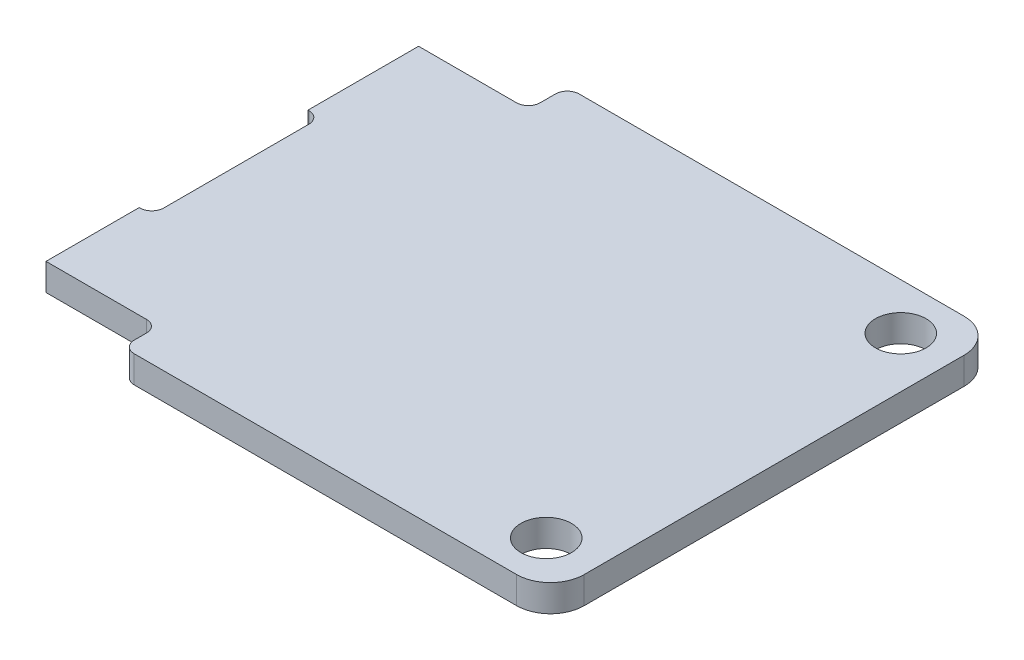
ISO-10303-21;
HEADER;
FILE_DESCRIPTION(('STEP AP214'),'2;1');
FILE_NAME('part.step','',(''),(''),'','','');
FILE_SCHEMA(('AUTOMOTIVE_DESIGN { 1 0 10303 214 1 1 1 1 }'));
ENDSEC;
DATA;
#1=APPLICATION_CONTEXT('core data for automotive mechanical design processes');
#2=APPLICATION_PROTOCOL_DEFINITION('international standard','automotive_design',2000,#1);
#3=PRODUCT_CONTEXT('',#1,'mechanical');
#4=PRODUCT('Part','Part','',(#3));
#5=PRODUCT_RELATED_PRODUCT_CATEGORY('part','',(#4));
#6=PRODUCT_DEFINITION_FORMATION('','',#4);
#7=PRODUCT_DEFINITION_CONTEXT('part definition',#1,'design');
#8=PRODUCT_DEFINITION('design','',#6,#7);
#9=PRODUCT_DEFINITION_SHAPE('','',#8);
#10=(LENGTH_UNIT() NAMED_UNIT(*) SI_UNIT(.MILLI.,.METRE.));
#11=(NAMED_UNIT(*) PLANE_ANGLE_UNIT() SI_UNIT($,.RADIAN.));
#12=(NAMED_UNIT(*) SI_UNIT($,.STERADIAN.) SOLID_ANGLE_UNIT());
#13=UNCERTAINTY_MEASURE_WITH_UNIT(LENGTH_MEASURE(1.E-05),#10,'distance_accuracy_value','');
#14=(GEOMETRIC_REPRESENTATION_CONTEXT(3) GLOBAL_UNCERTAINTY_ASSIGNED_CONTEXT((#13)) GLOBAL_UNIT_ASSIGNED_CONTEXT((#10,
#11,#12)) REPRESENTATION_CONTEXT('',''));
#15=CARTESIAN_POINT('',(0.,0.,0.));
#16=DIRECTION('',(0.,0.,1.));
#17=DIRECTION('',(1.,0.,0.));
#18=AXIS2_PLACEMENT_3D('',#15,#16,#17);
#19=CARTESIAN_POINT('',(-16.1521134954368,1.6,-3.69558790884931));
#20=DIRECTION('',(0.,-1.,0.));
#21=DIRECTION('',(0.,0.,-1.));
#22=AXIS2_PLACEMENT_3D('',#19,#20,#21);
#23=CYLINDRICAL_SURFACE('',#22,0.7);
#24=CARTESIAN_POINT('',(-16.1521134954368,0.,-3.69558790884931));
#25=DIRECTION('',(0.,1.,0.));
#26=DIRECTION('',(0.,0.,1.));
#27=AXIS2_PLACEMENT_3D('',#24,#25,#26);
#28=CIRCLE('',#27,0.7);
#29=CARTESIAN_POINT('',(-15.4521134954368,0.,-3.6955879088493));
#30=VERTEX_POINT('',#29);
#31=CARTESIAN_POINT('',(-16.1521134954368,0.,-4.39558790884931));
#32=VERTEX_POINT('',#31);
#33=EDGE_CURVE('E208',#30,#32,#28,.T.);
#34=ORIENTED_EDGE('',*,*,#33,.F.);
#35=DIRECTION('',(0.,-1.,0.));
#36=VECTOR('',#35,1.);
#37=CARTESIAN_POINT('',(-15.4521134954368,1.6,-3.6955879088493));
#38=LINE('',#37,#36);
#39=CARTESIAN_POINT('',(-15.4521134954368,1.6,-3.6955879088493));
#40=VERTEX_POINT('',#39);
#41=EDGE_CURVE('E11',#40,#30,#38,.T.);
#42=ORIENTED_EDGE('',*,*,#41,.F.);
#43=CARTESIAN_POINT('',(-16.1521134954368,1.6,-3.69558790884931));
#44=DIRECTION('',(0.,1.,0.));
#45=DIRECTION('',(0.,0.,1.));
#46=AXIS2_PLACEMENT_3D('',#43,#44,#45);
#47=CIRCLE('',#46,0.7);
#48=CARTESIAN_POINT('',(-16.1521134954368,1.6,-4.39558790884931));
#49=VERTEX_POINT('',#48);
#50=EDGE_CURVE('E264',#40,#49,#47,.T.);
#51=ORIENTED_EDGE('',*,*,#50,.T.);
#52=DIRECTION('',(0.,-1.,0.));
#53=VECTOR('',#52,1.);
#54=CARTESIAN_POINT('',(-16.1521134954368,1.6,-4.39558790884931));
#55=LINE('',#54,#53);
#56=EDGE_CURVE('E51',#49,#32,#55,.T.);
#57=ORIENTED_EDGE('',*,*,#56,.T.);
#58=EDGE_LOOP('',(#34,#42,#51,#57));
#59=FACE_BOUND('',#58,.T.);
#60=ADVANCED_FACE('F35',(#59),#23,.F.);
#61=CARTESIAN_POINT('',(-15.4521134954368,1.6,0.));
#62=DIRECTION('',(-1.,0.,0.));
#63=DIRECTION('',(0.,0.,1.));
#64=AXIS2_PLACEMENT_3D('',#61,#62,#63);
#65=PLANE('',#64);
#66=DIRECTION('',(0.,0.,-1.));
#67=VECTOR('',#66,1.);
#68=CARTESIAN_POINT('',(-15.4521134954368,0.,0.));
#69=LINE('',#68,#67);
#70=CARTESIAN_POINT('',(-15.4521134954368,0.,4.90441209115069));
#71=VERTEX_POINT('',#70);
#72=EDGE_CURVE('E210',#71,#30,#69,.T.);
#73=ORIENTED_EDGE('',*,*,#72,.F.);
#74=DIRECTION('',(0.,-1.,0.));
#75=VECTOR('',#74,1.);
#76=CARTESIAN_POINT('',(-15.4521134954368,1.6,4.90441209115069));
#77=LINE('',#76,#75);
#78=CARTESIAN_POINT('',(-15.4521134954368,1.6,4.90441209115069));
#79=VERTEX_POINT('',#78);
#80=EDGE_CURVE('E43',#79,#71,#77,.T.);
#81=ORIENTED_EDGE('',*,*,#80,.F.);
#82=DIRECTION('',(0.,0.,-1.));
#83=VECTOR('',#82,1.);
#84=CARTESIAN_POINT('',(-15.4521134954368,1.6,0.));
#85=LINE('',#84,#83);
#86=EDGE_CURVE('E325',#79,#40,#85,.T.);
#87=ORIENTED_EDGE('',*,*,#86,.T.);
#88=ORIENTED_EDGE('',*,*,#41,.T.);
#89=EDGE_LOOP('',(#73,#81,#87,#88));
#90=FACE_BOUND('',#89,.T.);
#91=ADVANCED_FACE('F310',(#90),#65,.T.);
#92=CARTESIAN_POINT('',(-16.1521134954368,1.6,4.90441209115069));
#93=DIRECTION('',(0.,-1.,0.));
#94=DIRECTION('',(0.,0.,-1.));
#95=AXIS2_PLACEMENT_3D('',#92,#93,#94);
#96=CYLINDRICAL_SURFACE('',#95,0.7);
#97=CARTESIAN_POINT('',(-16.1521134954368,0.,4.90441209115069));
#98=DIRECTION('',(0.,1.,0.));
#99=DIRECTION('',(0.,0.,1.));
#100=AXIS2_PLACEMENT_3D('',#97,#98,#99);
#101=CIRCLE('',#100,0.7);
#102=CARTESIAN_POINT('',(-16.1521134954368,0.,5.60441209115069));
#103=VERTEX_POINT('',#102);
#104=EDGE_CURVE('E213',#103,#71,#101,.T.);
#105=ORIENTED_EDGE('',*,*,#104,.F.);
#106=DIRECTION('',(0.,-1.,0.));
#107=VECTOR('',#106,1.);
#108=CARTESIAN_POINT('',(-16.1521134954368,1.6,5.60441209115069));
#109=LINE('',#108,#107);
#110=CARTESIAN_POINT('',(-16.1521134954368,1.6,5.60441209115069));
#111=VERTEX_POINT('',#110);
#112=EDGE_CURVE('E299',#111,#103,#109,.T.);
#113=ORIENTED_EDGE('',*,*,#112,.F.);
#114=CARTESIAN_POINT('',(-16.1521134954368,1.6,4.90441209115069));
#115=DIRECTION('',(0.,1.,0.));
#116=DIRECTION('',(0.,0.,1.));
#117=AXIS2_PLACEMENT_3D('',#114,#115,#116);
#118=CIRCLE('',#117,0.7);
#119=EDGE_CURVE('E306',#111,#79,#118,.T.);
#120=ORIENTED_EDGE('',*,*,#119,.T.);
#121=ORIENTED_EDGE('',*,*,#80,.T.);
#122=EDGE_LOOP('',(#105,#113,#120,#121));
#123=FACE_BOUND('',#122,.T.);
#124=ADVANCED_FACE('F304',(#123),#96,.F.);
#125=CARTESIAN_POINT('',(0.,1.6,5.60441209115069));
#126=DIRECTION('',(0.,0.,1.));
#127=DIRECTION('',(1.,0.,0.));
#128=AXIS2_PLACEMENT_3D('',#125,#126,#127);
#129=PLANE('',#128);
#130=DIRECTION('',(-1.,0.,0.));
#131=VECTOR('',#130,1.);
#132=CARTESIAN_POINT('',(0.,0.,5.60441209115069));
#133=LINE('',#132,#131);
#134=CARTESIAN_POINT('',(-16.2021134954368,0.,5.60441209115069));
#135=VERTEX_POINT('',#134);
#136=EDGE_CURVE('E216',#103,#135,#133,.T.);
#137=ORIENTED_EDGE('',*,*,#136,.T.);
#138=DIRECTION('',(0.,-1.,0.));
#139=VECTOR('',#138,1.);
#140=CARTESIAN_POINT('',(-16.2021134954368,1.6,5.60441209115069));
#141=LINE('',#140,#139);
#142=CARTESIAN_POINT('',(-16.2021134954368,1.6,5.60441209115069));
#143=VERTEX_POINT('',#142);
#144=EDGE_CURVE('E297',#143,#135,#141,.T.);
#145=ORIENTED_EDGE('',*,*,#144,.F.);
#146=DIRECTION('',(-1.,0.,0.));
#147=VECTOR('',#146,1.);
#148=CARTESIAN_POINT('',(0.,1.6,5.60441209115069));
#149=LINE('',#148,#147);
#150=EDGE_CURVE('E321',#111,#143,#149,.T.);
#151=ORIENTED_EDGE('',*,*,#150,.F.);
#152=ORIENTED_EDGE('',*,*,#112,.T.);
#153=EDGE_LOOP('',(#137,#145,#151,#152));
#154=FACE_BOUND('',#153,.T.);
#155=ADVANCED_FACE('F318',(#154),#129,.F.);
#156=CARTESIAN_POINT('',(-16.2021134954368,1.6,0.));
#157=DIRECTION('',(-1.,0.,0.));
#158=DIRECTION('',(0.,0.,1.));
#159=AXIS2_PLACEMENT_3D('',#156,#157,#158);
#160=PLANE('',#159);
#161=DIRECTION('',(0.,0.,-1.));
#162=VECTOR('',#161,1.);
#163=CARTESIAN_POINT('',(-16.2021134954368,0.,0.));
#164=LINE('',#163,#162);
#165=CARTESIAN_POINT('',(-16.2021134954368,0.,11.1242371037862));
#166=VERTEX_POINT('',#165);
#167=EDGE_CURVE('E219',#166,#135,#164,.T.);
#168=ORIENTED_EDGE('',*,*,#167,.F.);
#169=DIRECTION('',(0.,-1.,0.));
#170=VECTOR('',#169,1.);
#171=CARTESIAN_POINT('',(-16.2021134954368,1.6,11.1242371037862));
#172=LINE('',#171,#170);
#173=CARTESIAN_POINT('',(-16.2021134954368,1.6,11.1242371037862));
#174=VERTEX_POINT('',#173);
#175=EDGE_CURVE('E295',#174,#166,#172,.T.);
#176=ORIENTED_EDGE('',*,*,#175,.F.);
#177=DIRECTION('',(0.,0.,-1.));
#178=VECTOR('',#177,1.);
#179=CARTESIAN_POINT('',(-16.2021134954368,1.6,0.));
#180=LINE('',#179,#178);
#181=EDGE_CURVE('E323',#174,#143,#180,.T.);
#182=ORIENTED_EDGE('',*,*,#181,.T.);
#183=ORIENTED_EDGE('',*,*,#144,.T.);
#184=EDGE_LOOP('',(#168,#176,#182,#183));
#185=FACE_BOUND('',#184,.T.);
#186=ADVANCED_FACE('F551',(#185),#160,.T.);
#187=CARTESIAN_POINT('',(0.,1.6,11.1242371037862));
#188=DIRECTION('',(0.,0.,1.));
#189=DIRECTION('',(1.,0.,0.));
#190=AXIS2_PLACEMENT_3D('',#187,#188,#189);
#191=PLANE('',#190);
#192=DIRECTION('',(-1.,0.,0.));
#193=VECTOR('',#192,1.);
#194=CARTESIAN_POINT('',(0.,0.,11.1242371037862));
#195=LINE('',#194,#193);
#196=CARTESIAN_POINT('',(-10.2502914464559,0.,11.1242371037862));
#197=VERTEX_POINT('',#196);
#198=EDGE_CURVE('E222',#197,#166,#195,.T.);
#199=ORIENTED_EDGE('',*,*,#198,.F.);
#200=DIRECTION('',(0.,-1.,0.));
#201=VECTOR('',#200,1.);
#202=CARTESIAN_POINT('',(-10.2502914464559,1.6,11.1242371037862));
#203=LINE('',#202,#201);
#204=CARTESIAN_POINT('',(-10.2502914464559,1.6,11.1242371037862));
#205=VERTEX_POINT('',#204);
#206=EDGE_CURVE('E293',#205,#197,#203,.T.);
#207=ORIENTED_EDGE('',*,*,#206,.F.);
#208=DIRECTION('',(-1.,0.,0.));
#209=VECTOR('',#208,1.);
#210=CARTESIAN_POINT('',(0.,1.6,11.1242371037862));
#211=LINE('',#210,#209);
#212=EDGE_CURVE('E331',#205,#174,#211,.T.);
#213=ORIENTED_EDGE('',*,*,#212,.T.);
#214=ORIENTED_EDGE('',*,*,#175,.T.);
#215=EDGE_LOOP('',(#199,#207,#213,#214));
#216=FACE_BOUND('',#215,.T.);
#217=ADVANCED_FACE('F541',(#216),#191,.T.);
#218=CARTESIAN_POINT('',(-10.2502914464559,1.6,11.8242371037862));
#219=DIRECTION('',(0.,-1.,0.));
#220=DIRECTION('',(0.,0.,-1.));
#221=AXIS2_PLACEMENT_3D('',#218,#219,#220);
#222=CYLINDRICAL_SURFACE('',#221,0.7);
#223=CARTESIAN_POINT('',(-10.2502914464559,0.,11.8242371037862));
#224=DIRECTION('',(0.,1.,0.));
#225=DIRECTION('',(0.,0.,1.));
#226=AXIS2_PLACEMENT_3D('',#223,#224,#225);
#227=CIRCLE('',#226,0.7);
#228=CARTESIAN_POINT('',(-9.55029144645589,0.,11.8242371037862));
#229=VERTEX_POINT('',#228);
#230=EDGE_CURVE('E225',#197,#229,#227,.F.);
#231=ORIENTED_EDGE('',*,*,#230,.T.);
#232=DIRECTION('',(0.,-1.,0.));
#233=VECTOR('',#232,1.);
#234=CARTESIAN_POINT('',(-9.55029144645589,1.6,11.8242371037862));
#235=LINE('',#234,#233);
#236=CARTESIAN_POINT('',(-9.55029144645589,1.6,11.8242371037862));
#237=VERTEX_POINT('',#236);
#238=EDGE_CURVE('E290',#237,#229,#235,.T.);
#239=ORIENTED_EDGE('',*,*,#238,.F.);
#240=CARTESIAN_POINT('',(-10.2502914464559,1.6,11.8242371037862));
#241=DIRECTION('',(0.,1.,0.));
#242=DIRECTION('',(0.,0.,1.));
#243=AXIS2_PLACEMENT_3D('',#240,#241,#242);
#244=CIRCLE('',#243,0.7);
#245=EDGE_CURVE('E334',#205,#237,#244,.F.);
#246=ORIENTED_EDGE('',*,*,#245,.F.);
#247=ORIENTED_EDGE('',*,*,#206,.T.);
#248=EDGE_LOOP('',(#231,#239,#246,#247));
#249=FACE_BOUND('',#248,.T.);
#250=ADVANCED_FACE('F531',(#249),#222,.F.);
#251=CARTESIAN_POINT('',(-9.55029144645589,1.6,0.));
#252=DIRECTION('',(1.,0.,0.));
#253=DIRECTION('',(0.,0.,-1.));
#254=AXIS2_PLACEMENT_3D('',#251,#252,#253);
#255=PLANE('',#254);
#256=DIRECTION('',(0.,0.,1.));
#257=VECTOR('',#256,1.);
#258=CARTESIAN_POINT('',(-9.55029144645589,0.,0.));
#259=LINE('',#258,#257);
#260=CARTESIAN_POINT('',(-9.55029144645589,0.,12.55));
#261=VERTEX_POINT('',#260);
#262=EDGE_CURVE('E227',#229,#261,#259,.T.);
#263=ORIENTED_EDGE('',*,*,#262,.T.);
#264=DIRECTION('',(0.,-1.,0.));
#265=VECTOR('',#264,1.);
#266=CARTESIAN_POINT('',(-9.55029144645589,1.6,12.55));
#267=LINE('',#266,#265);
#268=CARTESIAN_POINT('',(-9.55029144645589,1.6,12.55));
#269=VERTEX_POINT('',#268);
#270=EDGE_CURVE('E287',#269,#261,#267,.T.);
#271=ORIENTED_EDGE('',*,*,#270,.F.);
#272=DIRECTION('',(0.,0.,1.));
#273=VECTOR('',#272,1.);
#274=CARTESIAN_POINT('',(-9.55029144645589,1.6,0.));
#275=LINE('',#274,#273);
#276=EDGE_CURVE('E336',#237,#269,#275,.T.);
#277=ORIENTED_EDGE('',*,*,#276,.F.);
#278=ORIENTED_EDGE('',*,*,#238,.T.);
#279=EDGE_LOOP('',(#263,#271,#277,#278));
#280=FACE_BOUND('',#279,.T.);
#281=ADVANCED_FACE('F521',(#280),#255,.F.);
#282=CARTESIAN_POINT('',(-8.85029144645589,1.6,12.55));
#283=DIRECTION('',(0.,-1.,0.));
#284=DIRECTION('',(0.,0.,-1.));
#285=AXIS2_PLACEMENT_3D('',#282,#283,#284);
#286=CYLINDRICAL_SURFACE('',#285,0.699999999999999);
#287=CARTESIAN_POINT('',(-8.85029144645589,0.,12.55));
#288=DIRECTION('',(0.,1.,0.));
#289=DIRECTION('',(0.,0.,1.));
#290=AXIS2_PLACEMENT_3D('',#287,#288,#289);
#291=CIRCLE('',#290,0.699999999999999);
#292=CARTESIAN_POINT('',(-8.85029144645589,0.,13.25));
#293=VERTEX_POINT('',#292);
#294=EDGE_CURVE('E229',#261,#293,#291,.T.);
#295=ORIENTED_EDGE('',*,*,#294,.T.);
#296=DIRECTION('',(0.,-1.,0.));
#297=VECTOR('',#296,1.);
#298=CARTESIAN_POINT('',(-8.85029144645589,1.6,13.25));
#299=LINE('',#298,#297);
#300=CARTESIAN_POINT('',(-8.85029144645589,1.6,13.25));
#301=VERTEX_POINT('',#300);
#302=EDGE_CURVE('E284',#301,#293,#299,.T.);
#303=ORIENTED_EDGE('',*,*,#302,.F.);
#304=CARTESIAN_POINT('',(-8.85029144645589,1.6,12.55));
#305=DIRECTION('',(0.,1.,0.));
#306=DIRECTION('',(0.,0.,1.));
#307=AXIS2_PLACEMENT_3D('',#304,#305,#306);
#308=CIRCLE('',#307,0.699999999999999);
#309=EDGE_CURVE('E338',#269,#301,#308,.T.);
#310=ORIENTED_EDGE('',*,*,#309,.F.);
#311=ORIENTED_EDGE('',*,*,#270,.T.);
#312=EDGE_LOOP('',(#295,#303,#310,#311));
#313=FACE_BOUND('',#312,.T.);
#314=ADVANCED_FACE('F511',(#313),#286,.T.);
#315=CARTESIAN_POINT('',(0.,1.6,13.25));
#316=DIRECTION('',(0.,0.,-1.));
#317=DIRECTION('',(-1.,0.,0.));
#318=AXIS2_PLACEMENT_3D('',#315,#316,#317);
#319=PLANE('',#318);
#320=DIRECTION('',(1.,0.,0.));
#321=VECTOR('',#320,1.);
#322=CARTESIAN_POINT('',(0.,0.,13.25));
#323=LINE('',#322,#321);
#324=CARTESIAN_POINT('',(13.7978865045632,0.,13.25));
#325=VERTEX_POINT('',#324);
#326=EDGE_CURVE('E231',#293,#325,#323,.T.);
#327=ORIENTED_EDGE('',*,*,#326,.T.);
#328=DIRECTION('',(0.,-1.,0.));
#329=VECTOR('',#328,1.);
#330=CARTESIAN_POINT('',(13.7978865045632,1.6,13.25));
#331=LINE('',#330,#329);
#332=CARTESIAN_POINT('',(13.7978865045632,1.6,13.25));
#333=VERTEX_POINT('',#332);
#334=EDGE_CURVE('E281',#333,#325,#331,.T.);
#335=ORIENTED_EDGE('',*,*,#334,.F.);
#336=DIRECTION('',(1.,0.,0.));
#337=VECTOR('',#336,1.);
#338=CARTESIAN_POINT('',(0.,1.6,13.25));
#339=LINE('',#338,#337);
#340=EDGE_CURVE('E340',#301,#333,#339,.T.);
#341=ORIENTED_EDGE('',*,*,#340,.F.);
#342=ORIENTED_EDGE('',*,*,#302,.T.);
#343=EDGE_LOOP('',(#327,#335,#341,#342));
#344=FACE_BOUND('',#343,.T.);
#345=ADVANCED_FACE('F501',(#344),#319,.F.);
#346=CARTESIAN_POINT('',(13.7978865045632,1.6,11.25));
#347=DIRECTION('',(0.,-1.,0.));
#348=DIRECTION('',(0.,0.,-1.));
#349=AXIS2_PLACEMENT_3D('',#346,#347,#348);
#350=CYLINDRICAL_SURFACE('',#349,2.);
#351=CARTESIAN_POINT('',(13.7978865045632,0.,11.25));
#352=DIRECTION('',(0.,1.,0.));
#353=DIRECTION('',(0.,0.,1.));
#354=AXIS2_PLACEMENT_3D('',#351,#352,#353);
#355=CIRCLE('',#354,2.);
#356=CARTESIAN_POINT('',(15.7978865045632,0.,11.25));
#357=VERTEX_POINT('',#356);
#358=EDGE_CURVE('E233',#325,#357,#355,.T.);
#359=ORIENTED_EDGE('',*,*,#358,.T.);
#360=DIRECTION('',(0.,-1.,0.));
#361=VECTOR('',#360,1.);
#362=CARTESIAN_POINT('',(15.7978865045632,1.6,11.25));
#363=LINE('',#362,#361);
#364=CARTESIAN_POINT('',(15.7978865045632,1.6,11.25));
#365=VERTEX_POINT('',#364);
#366=EDGE_CURVE('E278',#365,#357,#363,.T.);
#367=ORIENTED_EDGE('',*,*,#366,.F.);
#368=CARTESIAN_POINT('',(13.7978865045632,1.6,11.25));
#369=DIRECTION('',(0.,1.,0.));
#370=DIRECTION('',(0.,0.,1.));
#371=AXIS2_PLACEMENT_3D('',#368,#369,#370);
#372=CIRCLE('',#371,2.);
#373=EDGE_CURVE('E342',#333,#365,#372,.T.);
#374=ORIENTED_EDGE('',*,*,#373,.F.);
#375=ORIENTED_EDGE('',*,*,#334,.T.);
#376=EDGE_LOOP('',(#359,#367,#374,#375));
#377=FACE_BOUND('',#376,.T.);
#378=ADVANCED_FACE('F491',(#377),#350,.T.);
#379=CARTESIAN_POINT('',(15.7978865045632,1.6,0.));
#380=DIRECTION('',(-1.,0.,0.));
#381=DIRECTION('',(0.,0.,1.));
#382=AXIS2_PLACEMENT_3D('',#379,#380,#381);
#383=PLANE('',#382);
#384=DIRECTION('',(0.,0.,-1.));
#385=VECTOR('',#384,1.);
#386=CARTESIAN_POINT('',(15.7978865045632,0.,0.));
#387=LINE('',#386,#385);
#388=CARTESIAN_POINT('',(15.7978865045632,0.,-11.25));
#389=VERTEX_POINT('',#388);
#390=EDGE_CURVE('E235',#357,#389,#387,.T.);
#391=ORIENTED_EDGE('',*,*,#390,.T.);
#392=DIRECTION('',(0.,-1.,0.));
#393=VECTOR('',#392,1.);
#394=CARTESIAN_POINT('',(15.7978865045632,1.6,-11.25));
#395=LINE('',#394,#393);
#396=CARTESIAN_POINT('',(15.7978865045632,1.6,-11.25));
#397=VERTEX_POINT('',#396);
#398=EDGE_CURVE('E276',#397,#389,#395,.T.);
#399=ORIENTED_EDGE('',*,*,#398,.F.);
#400=DIRECTION('',(0.,0.,-1.));
#401=VECTOR('',#400,1.);
#402=CARTESIAN_POINT('',(15.7978865045632,1.6,0.));
#403=LINE('',#402,#401);
#404=EDGE_CURVE('E344',#365,#397,#403,.T.);
#405=ORIENTED_EDGE('',*,*,#404,.F.);
#406=ORIENTED_EDGE('',*,*,#366,.T.);
#407=EDGE_LOOP('',(#391,#399,#405,#406));
#408=FACE_BOUND('',#407,.T.);
#409=ADVANCED_FACE('F481',(#408),#383,.F.);
#410=CARTESIAN_POINT('',(13.7978865045632,1.6,-11.25));
#411=DIRECTION('',(0.,-1.,0.));
#412=DIRECTION('',(0.,0.,-1.));
#413=AXIS2_PLACEMENT_3D('',#410,#411,#412);
#414=CYLINDRICAL_SURFACE('',#413,2.);
#415=CARTESIAN_POINT('',(13.7978865045632,0.,-11.25));
#416=DIRECTION('',(0.,1.,0.));
#417=DIRECTION('',(0.,0.,1.));
#418=AXIS2_PLACEMENT_3D('',#415,#416,#417);
#419=CIRCLE('',#418,2.);
#420=CARTESIAN_POINT('',(13.7978865045632,0.,-13.25));
#421=VERTEX_POINT('',#420);
#422=EDGE_CURVE('E238',#421,#389,#419,.F.);
#423=ORIENTED_EDGE('',*,*,#422,.F.);
#424=DIRECTION('',(0.,-1.,0.));
#425=VECTOR('',#424,1.);
#426=CARTESIAN_POINT('',(13.7978865045632,1.6,-13.25));
#427=LINE('',#426,#425);
#428=CARTESIAN_POINT('',(13.7978865045632,1.6,-13.25));
#429=VERTEX_POINT('',#428);
#430=EDGE_CURVE('E274',#429,#421,#427,.T.);
#431=ORIENTED_EDGE('',*,*,#430,.F.);
#432=CARTESIAN_POINT('',(13.7978865045632,1.6,-11.25));
#433=DIRECTION('',(0.,1.,0.));
#434=DIRECTION('',(0.,0.,1.));
#435=AXIS2_PLACEMENT_3D('',#432,#433,#434);
#436=CIRCLE('',#435,2.);
#437=EDGE_CURVE('E346',#429,#397,#436,.F.);
#438=ORIENTED_EDGE('',*,*,#437,.T.);
#439=ORIENTED_EDGE('',*,*,#398,.T.);
#440=EDGE_LOOP('',(#423,#431,#438,#439));
#441=FACE_BOUND('',#440,.T.);
#442=ADVANCED_FACE('F471',(#441),#414,.T.);
#443=CARTESIAN_POINT('',(0.,1.6,-13.25));
#444=DIRECTION('',(0.,0.,-1.));
#445=DIRECTION('',(-1.,0.,0.));
#446=AXIS2_PLACEMENT_3D('',#443,#444,#445);
#447=PLANE('',#446);
#448=DIRECTION('',(1.,0.,0.));
#449=VECTOR('',#448,1.);
#450=CARTESIAN_POINT('',(0.,0.,-13.25));
#451=LINE('',#450,#449);
#452=CARTESIAN_POINT('',(-9.00211349543684,0.,-13.25));
#453=VERTEX_POINT('',#452);
#454=EDGE_CURVE('E241',#453,#421,#451,.T.);
#455=ORIENTED_EDGE('',*,*,#454,.F.);
#456=DIRECTION('',(0.,-1.,0.));
#457=VECTOR('',#456,1.);
#458=CARTESIAN_POINT('',(-9.00211349543684,1.6,-13.25));
#459=LINE('',#458,#457);
#460=CARTESIAN_POINT('',(-9.00211349543684,1.6,-13.25));
#461=VERTEX_POINT('',#460);
#462=EDGE_CURVE('E272',#461,#453,#459,.T.);
#463=ORIENTED_EDGE('',*,*,#462,.F.);
#464=DIRECTION('',(1.,0.,0.));
#465=VECTOR('',#464,1.);
#466=CARTESIAN_POINT('',(0.,1.6,-13.25));
#467=LINE('',#466,#465);
#468=EDGE_CURVE('E349',#461,#429,#467,.T.);
#469=ORIENTED_EDGE('',*,*,#468,.T.);
#470=ORIENTED_EDGE('',*,*,#430,.T.);
#471=EDGE_LOOP('',(#455,#463,#469,#470));
#472=FACE_BOUND('',#471,.T.);
#473=ADVANCED_FACE('F462',(#472),#447,.T.);
#474=CARTESIAN_POINT('',(-9.00211349543684,1.6,-12.55));
#475=DIRECTION('',(0.,-1.,0.));
#476=DIRECTION('',(0.,0.,-1.));
#477=AXIS2_PLACEMENT_3D('',#474,#475,#476);
#478=CYLINDRICAL_SURFACE('',#477,0.699999999999999);
#479=CARTESIAN_POINT('',(-9.00211349543684,0.,-12.55));
#480=DIRECTION('',(0.,1.,0.));
#481=DIRECTION('',(0.,0.,1.));
#482=AXIS2_PLACEMENT_3D('',#479,#480,#481);
#483=CIRCLE('',#482,0.699999999999999);
#484=CARTESIAN_POINT('',(-9.70211349543684,0.,-12.55));
#485=VERTEX_POINT('',#484);
#486=EDGE_CURVE('E244',#485,#453,#483,.F.);
#487=ORIENTED_EDGE('',*,*,#486,.F.);
#488=DIRECTION('',(0.,-1.,0.));
#489=VECTOR('',#488,1.);
#490=CARTESIAN_POINT('',(-9.70211349543684,1.6,-12.55));
#491=LINE('',#490,#489);
#492=CARTESIAN_POINT('',(-9.70211349543684,1.6,-12.55));
#493=VERTEX_POINT('',#492);
#494=EDGE_CURVE('E270',#493,#485,#491,.T.);
#495=ORIENTED_EDGE('',*,*,#494,.F.);
#496=CARTESIAN_POINT('',(-9.00211349543684,1.6,-12.55));
#497=DIRECTION('',(0.,1.,0.));
#498=DIRECTION('',(0.,0.,1.));
#499=AXIS2_PLACEMENT_3D('',#496,#497,#498);
#500=CIRCLE('',#499,0.699999999999999);
#501=EDGE_CURVE('E352',#493,#461,#500,.F.);
#502=ORIENTED_EDGE('',*,*,#501,.T.);
#503=ORIENTED_EDGE('',*,*,#462,.T.);
#504=EDGE_LOOP('',(#487,#495,#502,#503));
#505=FACE_BOUND('',#504,.T.);
#506=ADVANCED_FACE('F365',(#505),#478,.T.);
#507=CARTESIAN_POINT('',(-9.70211349543684,1.6,0.));
#508=DIRECTION('',(-1.,0.,0.));
#509=DIRECTION('',(0.,0.,1.));
#510=AXIS2_PLACEMENT_3D('',#507,#508,#509);
#511=PLANE('',#510);
#512=DIRECTION('',(0.,0.,-1.));
#513=VECTOR('',#512,1.);
#514=CARTESIAN_POINT('',(-9.70211349543684,0.,0.));
#515=LINE('',#514,#513);
#516=CARTESIAN_POINT('',(-9.70211349543684,0.,-11.6420670968703));
#517=VERTEX_POINT('',#516);
#518=EDGE_CURVE('E247',#517,#485,#515,.T.);
#519=ORIENTED_EDGE('',*,*,#518,.F.);
#520=DIRECTION('',(0.,-1.,0.));
#521=VECTOR('',#520,1.);
#522=CARTESIAN_POINT('',(-9.70211349543684,1.6,-11.6420670968703));
#523=LINE('',#522,#521);
#524=CARTESIAN_POINT('',(-9.70211349543684,1.6,-11.6420670968703));
#525=VERTEX_POINT('',#524);
#526=EDGE_CURVE('E268',#525,#517,#523,.T.);
#527=ORIENTED_EDGE('',*,*,#526,.F.);
#528=DIRECTION('',(0.,0.,-1.));
#529=VECTOR('',#528,1.);
#530=CARTESIAN_POINT('',(-9.70211349543684,1.6,0.));
#531=LINE('',#530,#529);
#532=EDGE_CURVE('E355',#525,#493,#531,.T.);
#533=ORIENTED_EDGE('',*,*,#532,.T.);
#534=ORIENTED_EDGE('',*,*,#494,.T.);
#535=EDGE_LOOP('',(#519,#527,#533,#534));
#536=FACE_BOUND('',#535,.T.);
#537=ADVANCED_FACE('F359',(#536),#511,.T.);
#538=CARTESIAN_POINT('',(-10.4021134954368,1.6,-11.6420670968703));
#539=DIRECTION('',(0.,-1.,0.));
#540=DIRECTION('',(0.,0.,-1.));
#541=AXIS2_PLACEMENT_3D('',#538,#539,#540);
#542=CYLINDRICAL_SURFACE('',#541,0.7);
#543=CARTESIAN_POINT('',(-10.4021134954368,0.,-11.6420670968703));
#544=DIRECTION('',(0.,1.,0.));
#545=DIRECTION('',(0.,0.,1.));
#546=AXIS2_PLACEMENT_3D('',#543,#544,#545);
#547=CIRCLE('',#546,0.7);
#548=CARTESIAN_POINT('',(-10.4021134954368,0.,-10.9420670968703));
#549=VERTEX_POINT('',#548);
#550=EDGE_CURVE('E250',#517,#549,#547,.F.);
#551=ORIENTED_EDGE('',*,*,#550,.T.);
#552=DIRECTION('',(0.,-1.,0.));
#553=VECTOR('',#552,1.);
#554=CARTESIAN_POINT('',(-10.4021134954368,1.6,-10.9420670968703));
#555=LINE('',#554,#553);
#556=CARTESIAN_POINT('',(-10.4021134954368,1.6,-10.9420670968703));
#557=VERTEX_POINT('',#556);
#558=EDGE_CURVE('E194',#557,#549,#555,.T.);
#559=ORIENTED_EDGE('',*,*,#558,.F.);
#560=CARTESIAN_POINT('',(-10.4021134954368,1.6,-11.6420670968703));
#561=DIRECTION('',(0.,1.,0.));
#562=DIRECTION('',(0.,0.,1.));
#563=AXIS2_PLACEMENT_3D('',#560,#561,#562);
#564=CIRCLE('',#563,0.7);
#565=EDGE_CURVE('E182',#525,#557,#564,.F.);
#566=ORIENTED_EDGE('',*,*,#565,.F.);
#567=ORIENTED_EDGE('',*,*,#526,.T.);
#568=EDGE_LOOP('',(#551,#559,#566,#567));
#569=FACE_BOUND('',#568,.T.);
#570=ADVANCED_FACE('F369',(#569),#542,.F.);
#571=CARTESIAN_POINT('',(0.,1.6,-10.9420670968703));
#572=DIRECTION('',(0.,0.,1.));
#573=DIRECTION('',(1.,0.,0.));
#574=AXIS2_PLACEMENT_3D('',#571,#572,#573);
#575=PLANE('',#574);
#576=DIRECTION('',(-1.,0.,0.));
#577=VECTOR('',#576,1.);
#578=CARTESIAN_POINT('',(0.,0.,-10.9420670968703));
#579=LINE('',#578,#577);
#580=CARTESIAN_POINT('',(-16.2021134954368,0.,-10.9420670968703));
#581=VERTEX_POINT('',#580);
#582=EDGE_CURVE('E191',#549,#581,#579,.T.);
#583=ORIENTED_EDGE('',*,*,#582,.T.);
#584=DIRECTION('',(0.,-1.,0.));
#585=VECTOR('',#584,1.);
#586=CARTESIAN_POINT('',(-16.2021134954368,1.6,-10.9420670968703));
#587=LINE('',#586,#585);
#588=CARTESIAN_POINT('',(-16.2021134954368,1.6,-10.9420670968703));
#589=VERTEX_POINT('',#588);
#590=EDGE_CURVE('E188',#589,#581,#587,.T.);
#591=ORIENTED_EDGE('',*,*,#590,.F.);
#592=DIRECTION('',(-1.,0.,0.));
#593=VECTOR('',#592,1.);
#594=CARTESIAN_POINT('',(0.,1.6,-10.9420670968703));
#595=LINE('',#594,#593);
#596=EDGE_CURVE('E173',#557,#589,#595,.T.);
#597=ORIENTED_EDGE('',*,*,#596,.F.);
#598=ORIENTED_EDGE('',*,*,#558,.T.);
#599=EDGE_LOOP('',(#583,#591,#597,#598));
#600=FACE_BOUND('',#599,.T.);
#601=ADVANCED_FACE('F189',(#600),#575,.F.);
#602=CARTESIAN_POINT('',(-16.2021134954368,1.6,0.));
#603=DIRECTION('',(-1.,0.,0.));
#604=DIRECTION('',(0.,0.,1.));
#605=AXIS2_PLACEMENT_3D('',#602,#603,#604);
#606=PLANE('',#605);
#607=DIRECTION('',(0.,0.,-1.));
#608=VECTOR('',#607,1.);
#609=CARTESIAN_POINT('',(-16.2021134954368,0.,0.));
#610=LINE('',#609,#608);
#611=CARTESIAN_POINT('',(-16.2021134954368,0.,-4.39558790884931));
#612=VERTEX_POINT('',#611);
#613=EDGE_CURVE('E253',#612,#581,#610,.T.);
#614=ORIENTED_EDGE('',*,*,#613,.F.);
#615=DIRECTION('',(0.,-1.,0.));
#616=VECTOR('',#615,1.);
#617=CARTESIAN_POINT('',(-16.2021134954368,1.6,-4.39558790884931));
#618=LINE('',#617,#616);
#619=CARTESIAN_POINT('',(-16.2021134954368,1.6,-4.39558790884931));
#620=VERTEX_POINT('',#619);
#621=EDGE_CURVE('E112',#620,#612,#618,.T.);
#622=ORIENTED_EDGE('',*,*,#621,.F.);
#623=DIRECTION('',(0.,0.,-1.));
#624=VECTOR('',#623,1.);
#625=CARTESIAN_POINT('',(-16.2021134954368,1.6,0.));
#626=LINE('',#625,#624);
#627=EDGE_CURVE('E179',#620,#589,#626,.T.);
#628=ORIENTED_EDGE('',*,*,#627,.T.);
#629=ORIENTED_EDGE('',*,*,#590,.T.);
#630=EDGE_LOOP('',(#614,#622,#628,#629));
#631=FACE_BOUND('',#630,.T.);
#632=ADVANCED_FACE('F196',(#631),#606,.T.);
#633=CARTESIAN_POINT('',(12.7978865045632,1.6,10.5));
#634=DIRECTION('',(0.,-1.,0.));
#635=DIRECTION('',(0.,0.,-1.));
#636=AXIS2_PLACEMENT_3D('',#633,#634,#635);
#637=CYLINDRICAL_SURFACE('',#636,1.5);
#638=CARTESIAN_POINT('',(12.7978865045632,1.6,10.5));
#639=DIRECTION('',(0.,1.,0.));
#640=DIRECTION('',(0.,0.,1.));
#641=AXIS2_PLACEMENT_3D('',#638,#639,#640);
#642=CIRCLE('',#641,1.5);
#643=CARTESIAN_POINT('',(12.7978865045632,1.6,12.));
#644=VERTEX_POINT('',#643);
#645=EDGE_CURVE('E199',#644,#644,#642,.T.);
#646=ORIENTED_EDGE('',*,*,#645,.T.);
#647=EDGE_LOOP('',(#646));
#648=FACE_BOUND('',#647,.T.);
#649=CARTESIAN_POINT('',(12.7978865045632,0.,10.5));
#650=DIRECTION('',(0.,1.,0.));
#651=DIRECTION('',(0.,0.,1.));
#652=AXIS2_PLACEMENT_3D('',#649,#650,#651);
#653=CIRCLE('',#652,1.5);
#654=CARTESIAN_POINT('',(12.7978865045632,0.,12.));
#655=VERTEX_POINT('',#654);
#656=EDGE_CURVE('E258',#655,#655,#653,.T.);
#657=ORIENTED_EDGE('',*,*,#656,.F.);
#658=EDGE_LOOP('',(#657));
#659=FACE_BOUND('',#658,.T.);
#660=ADVANCED_FACE('F385',(#648,#659),#637,.F.);
#661=CARTESIAN_POINT('',(0.,1.6,-4.39558790884931));
#662=DIRECTION('',(0.,0.,1.));
#663=DIRECTION('',(1.,0.,0.));
#664=AXIS2_PLACEMENT_3D('',#661,#662,#663);
#665=PLANE('',#664);
#666=DIRECTION('',(-1.,0.,0.));
#667=VECTOR('',#666,1.);
#668=CARTESIAN_POINT('',(0.,0.,-4.39558790884931));
#669=LINE('',#668,#667);
#670=EDGE_CURVE('E255',#32,#612,#669,.T.);
#671=ORIENTED_EDGE('',*,*,#670,.F.);
#672=ORIENTED_EDGE('',*,*,#56,.F.);
#673=DIRECTION('',(-1.,0.,0.));
#674=VECTOR('',#673,1.);
#675=CARTESIAN_POINT('',(0.,1.6,-4.39558790884931));
#676=LINE('',#675,#674);
#677=EDGE_CURVE('E197',#49,#620,#676,.T.);
#678=ORIENTED_EDGE('',*,*,#677,.T.);
#679=ORIENTED_EDGE('',*,*,#621,.T.);
#680=EDGE_LOOP('',(#671,#672,#678,#679));
#681=FACE_BOUND('',#680,.T.);
#682=ADVANCED_FACE('F382',(#681),#665,.T.);
#683=CARTESIAN_POINT('',(12.7978865045632,1.6,-10.5));
#684=DIRECTION('',(0.,-1.,0.));
#685=DIRECTION('',(0.,0.,-1.));
#686=AXIS2_PLACEMENT_3D('',#683,#684,#685);
#687=CYLINDRICAL_SURFACE('',#686,1.5);
#688=CARTESIAN_POINT('',(12.7978865045632,1.6,-10.5));
#689=DIRECTION('',(0.,1.,0.));
#690=DIRECTION('',(0.,0.,1.));
#691=AXIS2_PLACEMENT_3D('',#688,#689,#690);
#692=CIRCLE('',#691,1.5);
#693=CARTESIAN_POINT('',(12.7978865045632,1.6,-9.));
#694=VERTEX_POINT('',#693);
#695=EDGE_CURVE('E205',#694,#694,#692,.T.);
#696=ORIENTED_EDGE('',*,*,#695,.T.);
#697=EDGE_LOOP('',(#696));
#698=FACE_BOUND('',#697,.T.);
#699=CARTESIAN_POINT('',(12.7978865045632,0.,-10.5));
#700=DIRECTION('',(0.,1.,0.));
#701=DIRECTION('',(0.,0.,1.));
#702=AXIS2_PLACEMENT_3D('',#699,#700,#701);
#703=CIRCLE('',#702,1.5);
#704=CARTESIAN_POINT('',(12.7978865045632,0.,-9.));
#705=VERTEX_POINT('',#704);
#706=EDGE_CURVE('E261',#705,#705,#703,.T.);
#707=ORIENTED_EDGE('',*,*,#706,.F.);
#708=EDGE_LOOP('',(#707));
#709=FACE_BOUND('',#708,.T.);
#710=ADVANCED_FACE('F384',(#698,#709),#687,.F.);
#711=CARTESIAN_POINT('',(0.,1.6,0.));
#712=DIRECTION('',(0.,1.,0.));
#713=DIRECTION('',(0.,0.,1.));
#714=AXIS2_PLACEMENT_3D('',#711,#712,#713);
#715=PLANE('',#714);
#716=ORIENTED_EDGE('',*,*,#50,.F.);
#717=ORIENTED_EDGE('',*,*,#86,.F.);
#718=ORIENTED_EDGE('',*,*,#119,.F.);
#719=ORIENTED_EDGE('',*,*,#150,.T.);
#720=ORIENTED_EDGE('',*,*,#181,.F.);
#721=ORIENTED_EDGE('',*,*,#212,.F.);
#722=ORIENTED_EDGE('',*,*,#245,.T.);
#723=ORIENTED_EDGE('',*,*,#276,.T.);
#724=ORIENTED_EDGE('',*,*,#309,.T.);
#725=ORIENTED_EDGE('',*,*,#340,.T.);
#726=ORIENTED_EDGE('',*,*,#373,.T.);
#727=ORIENTED_EDGE('',*,*,#404,.T.);
#728=ORIENTED_EDGE('',*,*,#437,.F.);
#729=ORIENTED_EDGE('',*,*,#468,.F.);
#730=ORIENTED_EDGE('',*,*,#501,.F.);
#731=ORIENTED_EDGE('',*,*,#532,.F.);
#732=ORIENTED_EDGE('',*,*,#565,.T.);
#733=ORIENTED_EDGE('',*,*,#596,.T.);
#734=ORIENTED_EDGE('',*,*,#627,.F.);
#735=ORIENTED_EDGE('',*,*,#677,.F.);
#736=EDGE_LOOP('',(#716,#717,#718,#719,#720,#721,#722,#723,#724,#725,#726,#727,#728,#729,#730,
#731,#732,#733,#734,#735));
#737=FACE_BOUND('',#736,.T.);
#738=ORIENTED_EDGE('',*,*,#645,.F.);
#739=EDGE_LOOP('',(#738));
#740=FACE_BOUND('',#739,.T.);
#741=ORIENTED_EDGE('',*,*,#695,.F.);
#742=EDGE_LOOP('',(#741));
#743=FACE_BOUND('',#742,.T.);
#744=ADVANCED_FACE('F175',(#737,#740,#743),#715,.T.);
#745=CARTESIAN_POINT('',(0.,0.,0.));
#746=DIRECTION('',(0.,1.,0.));
#747=DIRECTION('',(0.,0.,1.));
#748=AXIS2_PLACEMENT_3D('',#745,#746,#747);
#749=PLANE('',#748);
#750=ORIENTED_EDGE('',*,*,#33,.T.);
#751=ORIENTED_EDGE('',*,*,#670,.T.);
#752=ORIENTED_EDGE('',*,*,#613,.T.);
#753=ORIENTED_EDGE('',*,*,#582,.F.);
#754=ORIENTED_EDGE('',*,*,#550,.F.);
#755=ORIENTED_EDGE('',*,*,#518,.T.);
#756=ORIENTED_EDGE('',*,*,#486,.T.);
#757=ORIENTED_EDGE('',*,*,#454,.T.);
#758=ORIENTED_EDGE('',*,*,#422,.T.);
#759=ORIENTED_EDGE('',*,*,#390,.F.);
#760=ORIENTED_EDGE('',*,*,#358,.F.);
#761=ORIENTED_EDGE('',*,*,#326,.F.);
#762=ORIENTED_EDGE('',*,*,#294,.F.);
#763=ORIENTED_EDGE('',*,*,#262,.F.);
#764=ORIENTED_EDGE('',*,*,#230,.F.);
#765=ORIENTED_EDGE('',*,*,#198,.T.);
#766=ORIENTED_EDGE('',*,*,#167,.T.);
#767=ORIENTED_EDGE('',*,*,#136,.F.);
#768=ORIENTED_EDGE('',*,*,#104,.T.);
#769=ORIENTED_EDGE('',*,*,#72,.T.);
#770=EDGE_LOOP('',(#750,#751,#752,#753,#754,#755,#756,#757,#758,#759,#760,#761,#762,#763,#764,
#765,#766,#767,#768,#769));
#771=FACE_BOUND('',#770,.T.);
#772=ORIENTED_EDGE('',*,*,#656,.T.);
#773=EDGE_LOOP('',(#772));
#774=FACE_BOUND('',#773,.T.);
#775=ORIENTED_EDGE('',*,*,#706,.T.);
#776=EDGE_LOOP('',(#775));
#777=FACE_BOUND('',#776,.T.);
#778=ADVANCED_FACE('F313',(#771,#774,#777),#749,.F.);
#779=CLOSED_SHELL('',(#60,#91,#124,#155,#186,#217,#250,#281,#314,#345,#378,#409,#442,#473,#506,
#537,#570,#601,#632,#660,#682,#710,#744,#778));
#780=MANIFOLD_SOLID_BREP('B2',#779);
#781=ADVANCED_BREP_SHAPE_REPRESENTATION('',(#18,#780),#14);
#782=SHAPE_DEFINITION_REPRESENTATION(#9,#781);
ENDSEC;
END-ISO-10303-21;
